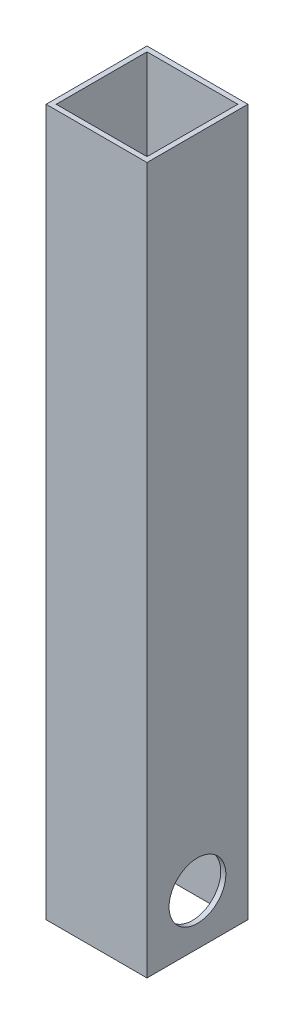
ISO-10303-21;
HEADER;
FILE_DESCRIPTION(('STEP AP214'),'2;1');
FILE_NAME('part.step','',(''),(''),'','','');
FILE_SCHEMA(('AUTOMOTIVE_DESIGN { 1 0 10303 214 1 1 1 1 }'));
ENDSEC;
DATA;
#1=APPLICATION_CONTEXT('core data for automotive mechanical design processes');
#2=APPLICATION_PROTOCOL_DEFINITION('international standard','automotive_design',2000,#1);
#3=PRODUCT_CONTEXT('',#1,'mechanical');
#4=PRODUCT('Part','Part','',(#3));
#5=PRODUCT_RELATED_PRODUCT_CATEGORY('part','',(#4));
#6=PRODUCT_DEFINITION_FORMATION('','',#4);
#7=PRODUCT_DEFINITION_CONTEXT('part definition',#1,'design');
#8=PRODUCT_DEFINITION('design','',#6,#7);
#9=PRODUCT_DEFINITION_SHAPE('','',#8);
#10=(LENGTH_UNIT() NAMED_UNIT(*) SI_UNIT(.MILLI.,.METRE.));
#11=(NAMED_UNIT(*) PLANE_ANGLE_UNIT() SI_UNIT($,.RADIAN.));
#12=(NAMED_UNIT(*) SI_UNIT($,.STERADIAN.) SOLID_ANGLE_UNIT());
#13=UNCERTAINTY_MEASURE_WITH_UNIT(LENGTH_MEASURE(1.E-05),#10,'distance_accuracy_value','');
#14=(GEOMETRIC_REPRESENTATION_CONTEXT(3) GLOBAL_UNCERTAINTY_ASSIGNED_CONTEXT((#13)) GLOBAL_UNIT_ASSIGNED_CONTEXT((#10,
#11,#12)) REPRESENTATION_CONTEXT('',''));
#15=CARTESIAN_POINT('',(0.,0.,0.));
#16=DIRECTION('',(0.,0.,1.));
#17=DIRECTION('',(1.,0.,0.));
#18=AXIS2_PLACEMENT_3D('',#15,#16,#17);
#19=CARTESIAN_POINT('',(0.,355.6,0.));
#20=DIRECTION('',(0.,1.,0.));
#21=DIRECTION('',(0.,0.,1.));
#22=AXIS2_PLACEMENT_3D('',#19,#20,#21);
#23=PLANE('',#22);
#24=DIRECTION('',(0.,0.,1.));
#25=VECTOR('',#24,1.);
#26=CARTESIAN_POINT('',(0.,355.6,0.));
#27=LINE('',#26,#25);
#28=CARTESIAN_POINT('',(0.,355.6,0.));
#29=VERTEX_POINT('',#28);
#30=CARTESIAN_POINT('',(0.,355.6,50.8));
#31=VERTEX_POINT('',#30);
#32=EDGE_CURVE('E149',#29,#31,#27,.T.);
#33=ORIENTED_EDGE('',*,*,#32,.T.);
#34=DIRECTION('',(1.,0.,0.));
#35=VECTOR('',#34,1.);
#36=CARTESIAN_POINT('',(0.,355.6,50.8));
#37=LINE('',#36,#35);
#38=CARTESIAN_POINT('',(50.8,355.6,50.8));
#39=VERTEX_POINT('',#38);
#40=EDGE_CURVE('E152',#31,#39,#37,.T.);
#41=ORIENTED_EDGE('',*,*,#40,.T.);
#42=DIRECTION('',(0.,0.,-1.));
#43=VECTOR('',#42,1.);
#44=CARTESIAN_POINT('',(50.8,355.6,0.));
#45=LINE('',#44,#43);
#46=CARTESIAN_POINT('',(50.8,355.6,0.));
#47=VERTEX_POINT('',#46);
#48=EDGE_CURVE('E155',#39,#47,#45,.T.);
#49=ORIENTED_EDGE('',*,*,#48,.T.);
#50=DIRECTION('',(-1.,0.,0.));
#51=VECTOR('',#50,1.);
#52=CARTESIAN_POINT('',(0.,355.6,0.));
#53=LINE('',#52,#51);
#54=EDGE_CURVE('E157',#47,#29,#53,.T.);
#55=ORIENTED_EDGE('',*,*,#54,.T.);
#56=EDGE_LOOP('',(#33,#41,#49,#55));
#57=FACE_BOUND('',#56,.T.);
#58=DIRECTION('',(1.,0.,0.));
#59=VECTOR('',#58,1.);
#60=CARTESIAN_POINT('',(2.54,355.6,48.26));
#61=LINE('',#60,#59);
#62=CARTESIAN_POINT('',(2.54,355.6,48.26));
#63=VERTEX_POINT('',#62);
#64=CARTESIAN_POINT('',(48.26,355.6,48.26));
#65=VERTEX_POINT('',#64);
#66=EDGE_CURVE('E119',#63,#65,#61,.T.);
#67=ORIENTED_EDGE('',*,*,#66,.F.);
#68=DIRECTION('',(0.,0.,1.));
#69=VECTOR('',#68,1.);
#70=CARTESIAN_POINT('',(2.54,355.6,2.54));
#71=LINE('',#70,#69);
#72=CARTESIAN_POINT('',(2.54,355.6,2.54));
#73=VERTEX_POINT('',#72);
#74=EDGE_CURVE('E111',#73,#63,#71,.T.);
#75=ORIENTED_EDGE('',*,*,#74,.F.);
#76=DIRECTION('',(-1.,0.,0.));
#77=VECTOR('',#76,1.);
#78=CARTESIAN_POINT('',(2.54,355.6,2.54));
#79=LINE('',#78,#77);
#80=CARTESIAN_POINT('',(48.26,355.6,2.54));
#81=VERTEX_POINT('',#80);
#82=EDGE_CURVE('E133',#81,#73,#79,.T.);
#83=ORIENTED_EDGE('',*,*,#82,.F.);
#84=DIRECTION('',(0.,0.,-1.));
#85=VECTOR('',#84,1.);
#86=CARTESIAN_POINT('',(48.26,355.6,2.54));
#87=LINE('',#86,#85);
#88=EDGE_CURVE('E131',#65,#81,#87,.T.);
#89=ORIENTED_EDGE('',*,*,#88,.F.);
#90=EDGE_LOOP('',(#67,#75,#83,#89));
#91=FACE_BOUND('',#90,.T.);
#92=ADVANCED_FACE('F45',(#57,#91),#23,.T.);
#93=CARTESIAN_POINT('',(0.,0.,0.));
#94=DIRECTION('',(0.,1.,0.));
#95=DIRECTION('',(0.,0.,1.));
#96=AXIS2_PLACEMENT_3D('',#93,#94,#95);
#97=PLANE('',#96);
#98=DIRECTION('',(0.,0.,1.));
#99=VECTOR('',#98,1.);
#100=CARTESIAN_POINT('',(0.,0.,0.));
#101=LINE('',#100,#99);
#102=CARTESIAN_POINT('',(0.,0.,0.));
#103=VERTEX_POINT('',#102);
#104=CARTESIAN_POINT('',(0.,0.,50.8));
#105=VERTEX_POINT('',#104);
#106=EDGE_CURVE('E127',#103,#105,#101,.T.);
#107=ORIENTED_EDGE('',*,*,#106,.F.);
#108=DIRECTION('',(-1.,0.,0.));
#109=VECTOR('',#108,1.);
#110=CARTESIAN_POINT('',(0.,0.,0.));
#111=LINE('',#110,#109);
#112=CARTESIAN_POINT('',(50.8,0.,0.));
#113=VERTEX_POINT('',#112);
#114=EDGE_CURVE('E153',#113,#103,#111,.T.);
#115=ORIENTED_EDGE('',*,*,#114,.F.);
#116=DIRECTION('',(0.,0.,-1.));
#117=VECTOR('',#116,1.);
#118=CARTESIAN_POINT('',(50.8,0.,0.));
#119=LINE('',#118,#117);
#120=CARTESIAN_POINT('',(50.8,0.,50.8));
#121=VERTEX_POINT('',#120);
#122=EDGE_CURVE('E164',#121,#113,#119,.T.);
#123=ORIENTED_EDGE('',*,*,#122,.F.);
#124=DIRECTION('',(1.,0.,0.));
#125=VECTOR('',#124,1.);
#126=CARTESIAN_POINT('',(0.,0.,50.8));
#127=LINE('',#126,#125);
#128=EDGE_CURVE('E162',#105,#121,#127,.T.);
#129=ORIENTED_EDGE('',*,*,#128,.F.);
#130=EDGE_LOOP('',(#107,#115,#123,#129));
#131=FACE_BOUND('',#130,.T.);
#132=DIRECTION('',(0.,0.,1.));
#133=VECTOR('',#132,1.);
#134=CARTESIAN_POINT('',(2.54,0.,2.54));
#135=LINE('',#134,#133);
#136=CARTESIAN_POINT('',(2.54,0.,2.54));
#137=VERTEX_POINT('',#136);
#138=CARTESIAN_POINT('',(2.54,0.,48.26));
#139=VERTEX_POINT('',#138);
#140=EDGE_CURVE('E69',#137,#139,#135,.T.);
#141=ORIENTED_EDGE('',*,*,#140,.T.);
#142=DIRECTION('',(1.,0.,0.));
#143=VECTOR('',#142,1.);
#144=CARTESIAN_POINT('',(2.54,0.,48.26));
#145=LINE('',#144,#143);
#146=CARTESIAN_POINT('',(48.26,0.,48.26));
#147=VERTEX_POINT('',#146);
#148=EDGE_CURVE('E126',#139,#147,#145,.T.);
#149=ORIENTED_EDGE('',*,*,#148,.T.);
#150=DIRECTION('',(0.,0.,-1.));
#151=VECTOR('',#150,1.);
#152=CARTESIAN_POINT('',(48.26,0.,2.54));
#153=LINE('',#152,#151);
#154=CARTESIAN_POINT('',(48.26,0.,2.54));
#155=VERTEX_POINT('',#154);
#156=EDGE_CURVE('E141',#147,#155,#153,.T.);
#157=ORIENTED_EDGE('',*,*,#156,.T.);
#158=DIRECTION('',(-1.,0.,0.));
#159=VECTOR('',#158,1.);
#160=CARTESIAN_POINT('',(2.54,0.,2.54));
#161=LINE('',#160,#159);
#162=EDGE_CURVE('E120',#155,#137,#161,.T.);
#163=ORIENTED_EDGE('',*,*,#162,.T.);
#164=EDGE_LOOP('',(#141,#149,#157,#163));
#165=FACE_BOUND('',#164,.T.);
#166=ADVANCED_FACE('F183',(#131,#165),#97,.F.);
#167=CARTESIAN_POINT('',(0.,355.6,0.));
#168=DIRECTION('',(1.,0.,0.));
#169=DIRECTION('',(0.,0.,-1.));
#170=AXIS2_PLACEMENT_3D('',#167,#168,#169);
#171=PLANE('',#170);
#172=CARTESIAN_POINT('',(0.,25.4,25.4));
#173=DIRECTION('',(-1.,0.,0.));
#174=DIRECTION('',(0.,0.,1.));
#175=AXIS2_PLACEMENT_3D('',#172,#173,#174);
#176=CIRCLE('',#175,14.2875);
#177=CARTESIAN_POINT('',(0.,25.4,39.6875));
#178=VERTEX_POINT('',#177);
#179=EDGE_CURVE('E229',#178,#178,#176,.T.);
#180=ORIENTED_EDGE('',*,*,#179,.F.);
#181=EDGE_LOOP('',(#180));
#182=FACE_BOUND('',#181,.T.);
#183=ORIENTED_EDGE('',*,*,#106,.T.);
#184=DIRECTION('',(0.,-1.,0.));
#185=VECTOR('',#184,1.);
#186=CARTESIAN_POINT('',(0.,355.6,50.8));
#187=LINE('',#186,#185);
#188=EDGE_CURVE('E11',#31,#105,#187,.T.);
#189=ORIENTED_EDGE('',*,*,#188,.F.);
#190=ORIENTED_EDGE('',*,*,#32,.F.);
#191=DIRECTION('',(0.,-1.,0.));
#192=VECTOR('',#191,1.);
#193=CARTESIAN_POINT('',(0.,355.6,0.));
#194=LINE('',#193,#192);
#195=EDGE_CURVE('E159',#29,#103,#194,.T.);
#196=ORIENTED_EDGE('',*,*,#195,.T.);
#197=EDGE_LOOP('',(#183,#189,#190,#196));
#198=FACE_BOUND('',#197,.T.);
#199=ADVANCED_FACE('F47',(#182,#198),#171,.F.);
#200=CARTESIAN_POINT('',(0.,355.6,50.8));
#201=DIRECTION('',(0.,0.,-1.));
#202=DIRECTION('',(-1.,0.,0.));
#203=AXIS2_PLACEMENT_3D('',#200,#201,#202);
#204=PLANE('',#203);
#205=ORIENTED_EDGE('',*,*,#128,.T.);
#206=DIRECTION('',(0.,-1.,0.));
#207=VECTOR('',#206,1.);
#208=CARTESIAN_POINT('',(50.8,355.6,50.8));
#209=LINE('',#208,#207);
#210=EDGE_CURVE('E54',#39,#121,#209,.T.);
#211=ORIENTED_EDGE('',*,*,#210,.F.);
#212=ORIENTED_EDGE('',*,*,#40,.F.);
#213=ORIENTED_EDGE('',*,*,#188,.T.);
#214=EDGE_LOOP('',(#205,#211,#212,#213));
#215=FACE_BOUND('',#214,.T.);
#216=ADVANCED_FACE('F193',(#215),#204,.F.);
#217=CARTESIAN_POINT('',(50.8,355.6,0.));
#218=DIRECTION('',(-1.,0.,0.));
#219=DIRECTION('',(0.,0.,1.));
#220=AXIS2_PLACEMENT_3D('',#217,#218,#219);
#221=PLANE('',#220);
#222=CARTESIAN_POINT('',(50.8,25.4,25.4));
#223=DIRECTION('',(-1.,0.,0.));
#224=DIRECTION('',(0.,0.,1.));
#225=AXIS2_PLACEMENT_3D('',#222,#223,#224);
#226=CIRCLE('',#225,14.2875);
#227=CARTESIAN_POINT('',(50.8,25.4,39.6875));
#228=VERTEX_POINT('',#227);
#229=EDGE_CURVE('E225',#228,#228,#226,.F.);
#230=ORIENTED_EDGE('',*,*,#229,.F.);
#231=EDGE_LOOP('',(#230));
#232=FACE_BOUND('',#231,.T.);
#233=ORIENTED_EDGE('',*,*,#122,.T.);
#234=DIRECTION('',(0.,-1.,0.));
#235=VECTOR('',#234,1.);
#236=CARTESIAN_POINT('',(50.8,355.6,0.));
#237=LINE('',#236,#235);
#238=EDGE_CURVE('E169',#47,#113,#237,.T.);
#239=ORIENTED_EDGE('',*,*,#238,.F.);
#240=ORIENTED_EDGE('',*,*,#48,.F.);
#241=ORIENTED_EDGE('',*,*,#210,.T.);
#242=EDGE_LOOP('',(#233,#239,#240,#241));
#243=FACE_BOUND('',#242,.T.);
#244=ADVANCED_FACE('F177',(#232,#243),#221,.F.);
#245=CARTESIAN_POINT('',(0.,355.6,0.));
#246=DIRECTION('',(0.,0.,1.));
#247=DIRECTION('',(1.,0.,0.));
#248=AXIS2_PLACEMENT_3D('',#245,#246,#247);
#249=PLANE('',#248);
#250=ORIENTED_EDGE('',*,*,#114,.T.);
#251=ORIENTED_EDGE('',*,*,#195,.F.);
#252=ORIENTED_EDGE('',*,*,#54,.F.);
#253=ORIENTED_EDGE('',*,*,#238,.T.);
#254=EDGE_LOOP('',(#250,#251,#252,#253));
#255=FACE_BOUND('',#254,.T.);
#256=ADVANCED_FACE('F187',(#255),#249,.F.);
#257=CARTESIAN_POINT('',(2.54,355.6,2.54));
#258=DIRECTION('',(1.,0.,0.));
#259=DIRECTION('',(0.,0.,-1.));
#260=AXIS2_PLACEMENT_3D('',#257,#258,#259);
#261=PLANE('',#260);
#262=CARTESIAN_POINT('',(2.54,25.4,25.4));
#263=DIRECTION('',(1.,0.,0.));
#264=DIRECTION('',(0.,0.,-1.));
#265=AXIS2_PLACEMENT_3D('',#262,#263,#264);
#266=CIRCLE('',#265,14.2875);
#267=CARTESIAN_POINT('',(2.54,25.4,11.1125));
#268=VERTEX_POINT('',#267);
#269=EDGE_CURVE('E139',#268,#268,#266,.T.);
#270=ORIENTED_EDGE('',*,*,#269,.F.);
#271=EDGE_LOOP('',(#270));
#272=FACE_BOUND('',#271,.T.);
#273=ORIENTED_EDGE('',*,*,#140,.F.);
#274=DIRECTION('',(0.,-1.,0.));
#275=VECTOR('',#274,1.);
#276=CARTESIAN_POINT('',(2.54,355.6,2.54));
#277=LINE('',#276,#275);
#278=EDGE_CURVE('E115',#73,#137,#277,.T.);
#279=ORIENTED_EDGE('',*,*,#278,.F.);
#280=ORIENTED_EDGE('',*,*,#74,.T.);
#281=DIRECTION('',(0.,-1.,0.));
#282=VECTOR('',#281,1.);
#283=CARTESIAN_POINT('',(2.54,355.6,48.26));
#284=LINE('',#283,#282);
#285=EDGE_CURVE('E114',#63,#139,#284,.T.);
#286=ORIENTED_EDGE('',*,*,#285,.T.);
#287=EDGE_LOOP('',(#273,#279,#280,#286));
#288=FACE_BOUND('',#287,.T.);
#289=ADVANCED_FACE('F113',(#272,#288),#261,.T.);
#290=CARTESIAN_POINT('',(2.54,355.6,48.26));
#291=DIRECTION('',(0.,0.,-1.));
#292=DIRECTION('',(-1.,0.,0.));
#293=AXIS2_PLACEMENT_3D('',#290,#291,#292);
#294=PLANE('',#293);
#295=ORIENTED_EDGE('',*,*,#148,.F.);
#296=ORIENTED_EDGE('',*,*,#285,.F.);
#297=ORIENTED_EDGE('',*,*,#66,.T.);
#298=DIRECTION('',(0.,-1.,0.));
#299=VECTOR('',#298,1.);
#300=CARTESIAN_POINT('',(48.26,355.6,48.26));
#301=LINE('',#300,#299);
#302=EDGE_CURVE('E128',#65,#147,#301,.T.);
#303=ORIENTED_EDGE('',*,*,#302,.T.);
#304=EDGE_LOOP('',(#295,#296,#297,#303));
#305=FACE_BOUND('',#304,.T.);
#306=ADVANCED_FACE('F123',(#305),#294,.T.);
#307=CARTESIAN_POINT('',(48.26,355.6,2.54));
#308=DIRECTION('',(-1.,0.,0.));
#309=DIRECTION('',(0.,0.,1.));
#310=AXIS2_PLACEMENT_3D('',#307,#308,#309);
#311=PLANE('',#310);
#312=CARTESIAN_POINT('',(48.26,25.4,25.4));
#313=DIRECTION('',(-1.,0.,0.));
#314=DIRECTION('',(0.,0.,1.));
#315=AXIS2_PLACEMENT_3D('',#312,#313,#314);
#316=CIRCLE('',#315,14.2875);
#317=CARTESIAN_POINT('',(48.26,25.4,39.6875));
#318=VERTEX_POINT('',#317);
#319=EDGE_CURVE('E49',#318,#318,#316,.T.);
#320=ORIENTED_EDGE('',*,*,#319,.F.);
#321=EDGE_LOOP('',(#320));
#322=FACE_BOUND('',#321,.T.);
#323=ORIENTED_EDGE('',*,*,#156,.F.);
#324=ORIENTED_EDGE('',*,*,#302,.F.);
#325=ORIENTED_EDGE('',*,*,#88,.T.);
#326=DIRECTION('',(0.,-1.,0.));
#327=VECTOR('',#326,1.);
#328=CARTESIAN_POINT('',(48.26,355.6,2.54));
#329=LINE('',#328,#327);
#330=EDGE_CURVE('E61',#81,#155,#329,.T.);
#331=ORIENTED_EDGE('',*,*,#330,.T.);
#332=EDGE_LOOP('',(#323,#324,#325,#331));
#333=FACE_BOUND('',#332,.T.);
#334=ADVANCED_FACE('F220',(#322,#333),#311,.T.);
#335=CARTESIAN_POINT('',(2.54,355.6,2.54));
#336=DIRECTION('',(0.,0.,1.));
#337=DIRECTION('',(1.,0.,0.));
#338=AXIS2_PLACEMENT_3D('',#335,#336,#337);
#339=PLANE('',#338);
#340=ORIENTED_EDGE('',*,*,#162,.F.);
#341=ORIENTED_EDGE('',*,*,#330,.F.);
#342=ORIENTED_EDGE('',*,*,#82,.T.);
#343=ORIENTED_EDGE('',*,*,#278,.T.);
#344=EDGE_LOOP('',(#340,#341,#342,#343));
#345=FACE_BOUND('',#344,.T.);
#346=ADVANCED_FACE('F240',(#345),#339,.T.);
#347=CARTESIAN_POINT('',(91.2111525448112,25.4,25.4));
#348=DIRECTION('',(-1.,0.,0.));
#349=DIRECTION('',(0.,0.,1.));
#350=AXIS2_PLACEMENT_3D('',#347,#348,#349);
#351=CYLINDRICAL_SURFACE('',#350,14.2875);
#352=ORIENTED_EDGE('',*,*,#319,.T.);
#353=EDGE_LOOP('',(#352));
#354=FACE_BOUND('',#353,.T.);
#355=ORIENTED_EDGE('',*,*,#229,.T.);
#356=EDGE_LOOP('',(#355));
#357=FACE_BOUND('',#356,.T.);
#358=ADVANCED_FACE('F235',(#354,#357),#351,.F.);
#359=ORIENTED_EDGE('',*,*,#269,.T.);
#360=EDGE_LOOP('',(#359));
#361=FACE_BOUND('',#360,.T.);
#362=ORIENTED_EDGE('',*,*,#179,.T.);
#363=EDGE_LOOP('',(#362));
#364=FACE_BOUND('',#363,.T.);
#365=ADVANCED_FACE('F233',(#361,#364),#351,.F.);
#366=CLOSED_SHELL('',(#92,#166,#199,#216,#244,#256,#289,#306,#334,#346,#358,#365));
#367=MANIFOLD_SOLID_BREP('B2',#366);
#368=ADVANCED_BREP_SHAPE_REPRESENTATION('',(#18,#367),#14);
#369=SHAPE_DEFINITION_REPRESENTATION(#9,#368);
ENDSEC;
END-ISO-10303-21;
